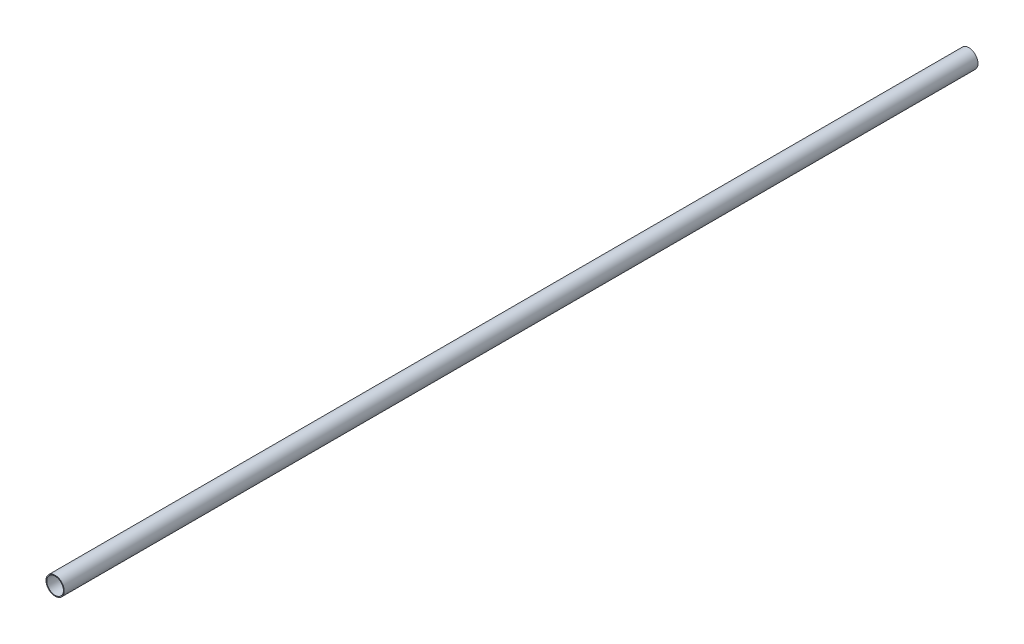
ISO-10303-21;
HEADER;
FILE_DESCRIPTION(('STEP AP214'),'2;1');
FILE_NAME('part.step','',(''),(''),'','','');
FILE_SCHEMA(('AUTOMOTIVE_DESIGN { 1 0 10303 214 1 1 1 1 }'));
ENDSEC;
DATA;
#1=APPLICATION_CONTEXT('core data for automotive mechanical design processes');
#2=APPLICATION_PROTOCOL_DEFINITION('international standard','automotive_design',2000,#1);
#3=PRODUCT_CONTEXT('',#1,'mechanical');
#4=PRODUCT('Part','Part','',(#3));
#5=PRODUCT_RELATED_PRODUCT_CATEGORY('part','',(#4));
#6=PRODUCT_DEFINITION_FORMATION('','',#4);
#7=PRODUCT_DEFINITION_CONTEXT('part definition',#1,'design');
#8=PRODUCT_DEFINITION('design','',#6,#7);
#9=PRODUCT_DEFINITION_SHAPE('','',#8);
#10=(LENGTH_UNIT() NAMED_UNIT(*) SI_UNIT(.MILLI.,.METRE.));
#11=(NAMED_UNIT(*) PLANE_ANGLE_UNIT() SI_UNIT($,.RADIAN.));
#12=(NAMED_UNIT(*) SI_UNIT($,.STERADIAN.) SOLID_ANGLE_UNIT());
#13=UNCERTAINTY_MEASURE_WITH_UNIT(LENGTH_MEASURE(1.E-05),#10,'distance_accuracy_value','');
#14=(GEOMETRIC_REPRESENTATION_CONTEXT(3) GLOBAL_UNCERTAINTY_ASSIGNED_CONTEXT((#13)) GLOBAL_UNIT_ASSIGNED_CONTEXT((#10,
#11,#12)) REPRESENTATION_CONTEXT('',''));
#15=CARTESIAN_POINT('',(0.,0.,0.));
#16=DIRECTION('',(0.,0.,1.));
#17=DIRECTION('',(1.,0.,0.));
#18=AXIS2_PLACEMENT_3D('',#15,#16,#17);
#19=CARTESIAN_POINT('',(0.,0.,1100.));
#20=DIRECTION('',(0.,0.,1.));
#21=DIRECTION('',(1.,0.,0.));
#22=AXIS2_PLACEMENT_3D('',#19,#20,#21);
#23=PLANE('',#22);
#24=CARTESIAN_POINT('',(0.,0.,1100.));
#25=DIRECTION('',(0.,0.,1.));
#26=DIRECTION('',(1.,0.,0.));
#27=AXIS2_PLACEMENT_3D('',#24,#25,#26);
#28=CIRCLE('',#27,11.);
#29=CARTESIAN_POINT('',(11.,0.,1100.));
#30=VERTEX_POINT('',#29);
#31=EDGE_CURVE('E10',#30,#30,#28,.T.);
#32=ORIENTED_EDGE('',*,*,#31,.T.);
#33=EDGE_LOOP('',(#32));
#34=FACE_BOUND('',#33,.T.);
#35=CARTESIAN_POINT('',(0.,0.,1100.));
#36=DIRECTION('',(0.,0.,1.));
#37=DIRECTION('',(1.,0.,0.));
#38=AXIS2_PLACEMENT_3D('',#35,#36,#37);
#39=CIRCLE('',#38,10.);
#40=CARTESIAN_POINT('',(10.,0.,1100.));
#41=VERTEX_POINT('',#40);
#42=EDGE_CURVE('E50',#41,#41,#39,.T.);
#43=ORIENTED_EDGE('',*,*,#42,.F.);
#44=EDGE_LOOP('',(#43));
#45=FACE_BOUND('',#44,.T.);
#46=ADVANCED_FACE('F37',(#34,#45),#23,.T.);
#47=CARTESIAN_POINT('',(0.,0.,0.));
#48=DIRECTION('',(0.,0.,1.));
#49=DIRECTION('',(1.,0.,0.));
#50=AXIS2_PLACEMENT_3D('',#47,#48,#49);
#51=PLANE('',#50);
#52=CARTESIAN_POINT('',(0.,0.,0.));
#53=DIRECTION('',(0.,0.,1.));
#54=DIRECTION('',(1.,0.,0.));
#55=AXIS2_PLACEMENT_3D('',#52,#53,#54);
#56=CIRCLE('',#55,11.);
#57=CARTESIAN_POINT('',(11.,0.,0.));
#58=VERTEX_POINT('',#57);
#59=EDGE_CURVE('E41',#58,#58,#56,.T.);
#60=ORIENTED_EDGE('',*,*,#59,.F.);
#61=EDGE_LOOP('',(#60));
#62=FACE_BOUND('',#61,.T.);
#63=CARTESIAN_POINT('',(0.,0.,0.));
#64=DIRECTION('',(0.,0.,1.));
#65=DIRECTION('',(1.,0.,0.));
#66=AXIS2_PLACEMENT_3D('',#63,#64,#65);
#67=CIRCLE('',#66,10.);
#68=CARTESIAN_POINT('',(10.,0.,0.));
#69=VERTEX_POINT('',#68);
#70=EDGE_CURVE('E52',#69,#69,#67,.T.);
#71=ORIENTED_EDGE('',*,*,#70,.T.);
#72=EDGE_LOOP('',(#71));
#73=FACE_BOUND('',#72,.T.);
#74=ADVANCED_FACE('F64',(#62,#73),#51,.F.);
#75=CARTESIAN_POINT('',(0.,0.,1100.));
#76=DIRECTION('',(0.,0.,-1.));
#77=DIRECTION('',(-1.,0.,0.));
#78=AXIS2_PLACEMENT_3D('',#75,#76,#77);
#79=CYLINDRICAL_SURFACE('',#78,11.);
#80=ORIENTED_EDGE('',*,*,#31,.F.);
#81=EDGE_LOOP('',(#80));
#82=FACE_BOUND('',#81,.T.);
#83=ORIENTED_EDGE('',*,*,#59,.T.);
#84=EDGE_LOOP('',(#83));
#85=FACE_BOUND('',#84,.T.);
#86=ADVANCED_FACE('F39',(#82,#85),#79,.T.);
#87=CARTESIAN_POINT('',(0.,0.,1100.));
#88=DIRECTION('',(0.,0.,-1.));
#89=DIRECTION('',(-1.,0.,0.));
#90=AXIS2_PLACEMENT_3D('',#87,#88,#89);
#91=CYLINDRICAL_SURFACE('',#90,10.);
#92=ORIENTED_EDGE('',*,*,#42,.T.);
#93=EDGE_LOOP('',(#92));
#94=FACE_BOUND('',#93,.T.);
#95=ORIENTED_EDGE('',*,*,#70,.F.);
#96=EDGE_LOOP('',(#95));
#97=FACE_BOUND('',#96,.T.);
#98=ADVANCED_FACE('F60',(#94,#97),#91,.F.);
#99=CLOSED_SHELL('',(#46,#74,#86,#98));
#100=MANIFOLD_SOLID_BREP('B2',#99);
#101=ADVANCED_BREP_SHAPE_REPRESENTATION('',(#18,#100),#14);
#102=SHAPE_DEFINITION_REPRESENTATION(#9,#101);
ENDSEC;
END-ISO-10303-21;
